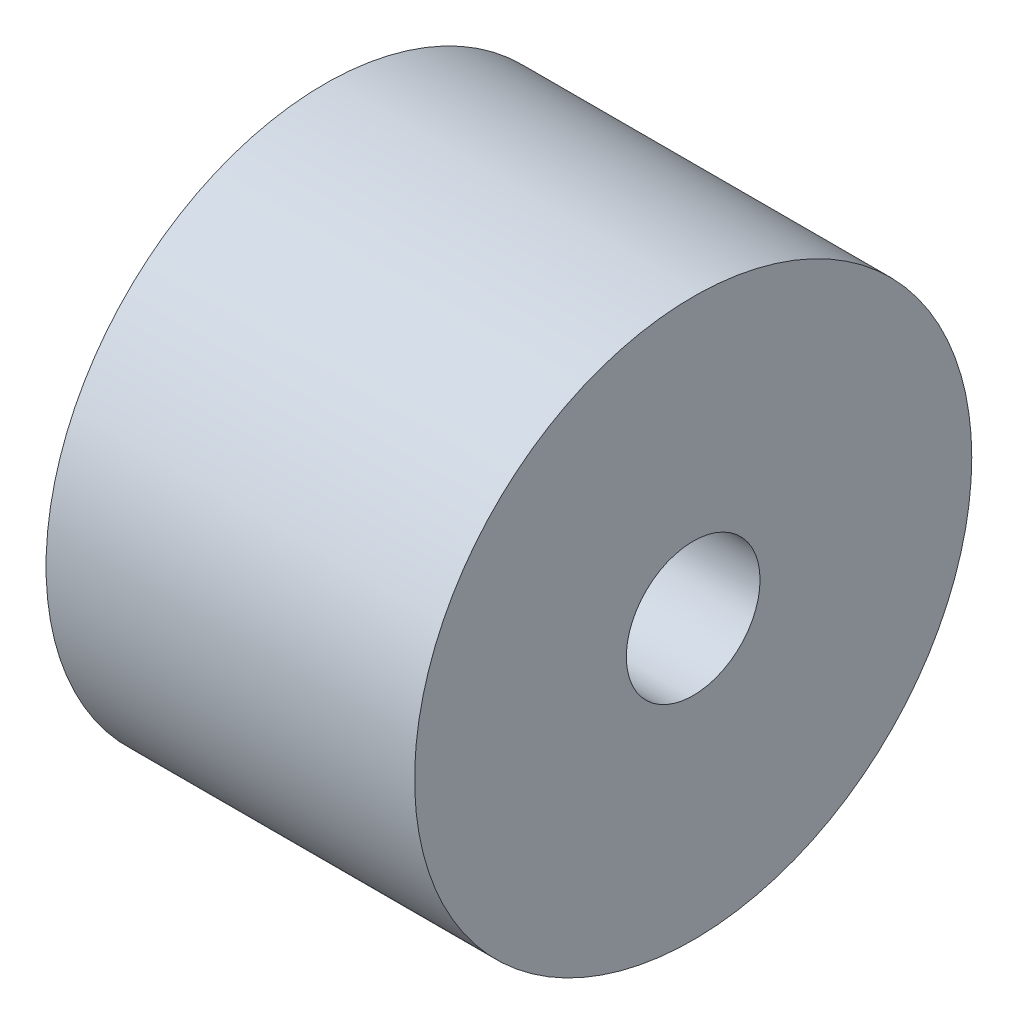
ISO-10303-21;
HEADER;
FILE_DESCRIPTION(('STEP AP214'),'2;1');
FILE_NAME('part.step','',(''),(''),'','','');
FILE_SCHEMA(('AUTOMOTIVE_DESIGN { 1 0 10303 214 1 1 1 1 }'));
ENDSEC;
DATA;
#1=APPLICATION_CONTEXT('core data for automotive mechanical design processes');
#2=APPLICATION_PROTOCOL_DEFINITION('international standard','automotive_design',2000,#1);
#3=PRODUCT_CONTEXT('',#1,'mechanical');
#4=PRODUCT('Part','Part','',(#3));
#5=PRODUCT_RELATED_PRODUCT_CATEGORY('part','',(#4));
#6=PRODUCT_DEFINITION_FORMATION('','',#4);
#7=PRODUCT_DEFINITION_CONTEXT('part definition',#1,'design');
#8=PRODUCT_DEFINITION('design','',#6,#7);
#9=PRODUCT_DEFINITION_SHAPE('','',#8);
#10=(LENGTH_UNIT() NAMED_UNIT(*) SI_UNIT(.MILLI.,.METRE.));
#11=(NAMED_UNIT(*) PLANE_ANGLE_UNIT() SI_UNIT($,.RADIAN.));
#12=(NAMED_UNIT(*) SI_UNIT($,.STERADIAN.) SOLID_ANGLE_UNIT());
#13=UNCERTAINTY_MEASURE_WITH_UNIT(LENGTH_MEASURE(1.E-05),#10,'distance_accuracy_value','');
#14=(GEOMETRIC_REPRESENTATION_CONTEXT(3) GLOBAL_UNCERTAINTY_ASSIGNED_CONTEXT((#13)) GLOBAL_UNIT_ASSIGNED_CONTEXT((#10,
#11,#12)) REPRESENTATION_CONTEXT('',''));
#15=CARTESIAN_POINT('',(0.,0.,0.));
#16=DIRECTION('',(0.,0.,1.));
#17=DIRECTION('',(1.,0.,0.));
#18=AXIS2_PLACEMENT_3D('',#15,#16,#17);
#19=CARTESIAN_POINT('',(0.,7.9375,0.));
#20=DIRECTION('',(-1.,0.,0.));
#21=DIRECTION('',(0.,0.,1.));
#22=AXIS2_PLACEMENT_3D('',#19,#20,#21);
#23=PLANE('',#22);
#24=CARTESIAN_POINT('',(0.,0.,0.));
#25=DIRECTION('',(1.,0.,0.));
#26=DIRECTION('',(0.,0.,-1.));
#27=AXIS2_PLACEMENT_3D('',#24,#25,#26);
#28=CIRCLE('',#27,1.905);
#29=CARTESIAN_POINT('',(0.,0.,-1.905));
#30=VERTEX_POINT('',#29);
#31=EDGE_CURVE('E12',#30,#30,#28,.T.);
#32=ORIENTED_EDGE('',*,*,#31,.T.);
#33=EDGE_LOOP('',(#32));
#34=FACE_BOUND('',#33,.T.);
#35=CARTESIAN_POINT('',(0.,0.,0.));
#36=DIRECTION('',(1.,0.,0.));
#37=DIRECTION('',(0.,0.,-1.));
#38=AXIS2_PLACEMENT_3D('',#35,#36,#37);
#39=CIRCLE('',#38,7.9375);
#40=CARTESIAN_POINT('',(0.,0.,-7.9375));
#41=VERTEX_POINT('',#40);
#42=EDGE_CURVE('E56',#41,#41,#39,.T.);
#43=ORIENTED_EDGE('',*,*,#42,.F.);
#44=EDGE_LOOP('',(#43));
#45=FACE_BOUND('',#44,.T.);
#46=ADVANCED_FACE('F42',(#34,#45),#23,.T.);
#47=CARTESIAN_POINT('',(0.,0.,0.));
#48=DIRECTION('',(1.,0.,0.));
#49=DIRECTION('',(0.,0.,-1.));
#50=AXIS2_PLACEMENT_3D('',#47,#48,#49);
#51=CYLINDRICAL_SURFACE('',#50,1.905);
#52=CARTESIAN_POINT('',(10.5,0.,0.));
#53=DIRECTION('',(1.,0.,0.));
#54=DIRECTION('',(0.,0.,-1.));
#55=AXIS2_PLACEMENT_3D('',#52,#53,#54);
#56=CIRCLE('',#55,1.905);
#57=CARTESIAN_POINT('',(10.5,0.,-1.905));
#58=VERTEX_POINT('',#57);
#59=EDGE_CURVE('E48',#58,#58,#56,.T.);
#60=ORIENTED_EDGE('',*,*,#59,.T.);
#61=EDGE_LOOP('',(#60));
#62=FACE_BOUND('',#61,.T.);
#63=ORIENTED_EDGE('',*,*,#31,.F.);
#64=EDGE_LOOP('',(#63));
#65=FACE_BOUND('',#64,.T.);
#66=ADVANCED_FACE('F66',(#62,#65),#51,.F.);
#67=CARTESIAN_POINT('',(10.5,7.9375,0.));
#68=DIRECTION('',(1.,0.,0.));
#69=DIRECTION('',(0.,0.,-1.));
#70=AXIS2_PLACEMENT_3D('',#67,#68,#69);
#71=PLANE('',#70);
#72=CARTESIAN_POINT('',(10.5,0.,0.));
#73=DIRECTION('',(1.,0.,0.));
#74=DIRECTION('',(0.,0.,-1.));
#75=AXIS2_PLACEMENT_3D('',#72,#73,#74);
#76=CIRCLE('',#75,7.9375);
#77=CARTESIAN_POINT('',(10.5,0.,-7.9375));
#78=VERTEX_POINT('',#77);
#79=EDGE_CURVE('E52',#78,#78,#76,.T.);
#80=ORIENTED_EDGE('',*,*,#79,.T.);
#81=EDGE_LOOP('',(#80));
#82=FACE_BOUND('',#81,.T.);
#83=ORIENTED_EDGE('',*,*,#59,.F.);
#84=EDGE_LOOP('',(#83));
#85=FACE_BOUND('',#84,.T.);
#86=ADVANCED_FACE('F70',(#82,#85),#71,.T.);
#87=CARTESIAN_POINT('',(0.,0.,0.));
#88=DIRECTION('',(1.,0.,0.));
#89=DIRECTION('',(0.,0.,-1.));
#90=AXIS2_PLACEMENT_3D('',#87,#88,#89);
#91=CYLINDRICAL_SURFACE('',#90,7.9375);
#92=ORIENTED_EDGE('',*,*,#42,.T.);
#93=EDGE_LOOP('',(#92));
#94=FACE_BOUND('',#93,.T.);
#95=ORIENTED_EDGE('',*,*,#79,.F.);
#96=EDGE_LOOP('',(#95));
#97=FACE_BOUND('',#96,.T.);
#98=ADVANCED_FACE('F62',(#94,#97),#91,.T.);
#99=CLOSED_SHELL('',(#46,#66,#86,#98));
#100=MANIFOLD_SOLID_BREP('B2',#99);
#101=ADVANCED_BREP_SHAPE_REPRESENTATION('',(#18,#100),#14);
#102=SHAPE_DEFINITION_REPRESENTATION(#9,#101);
ENDSEC;
END-ISO-10303-21;
